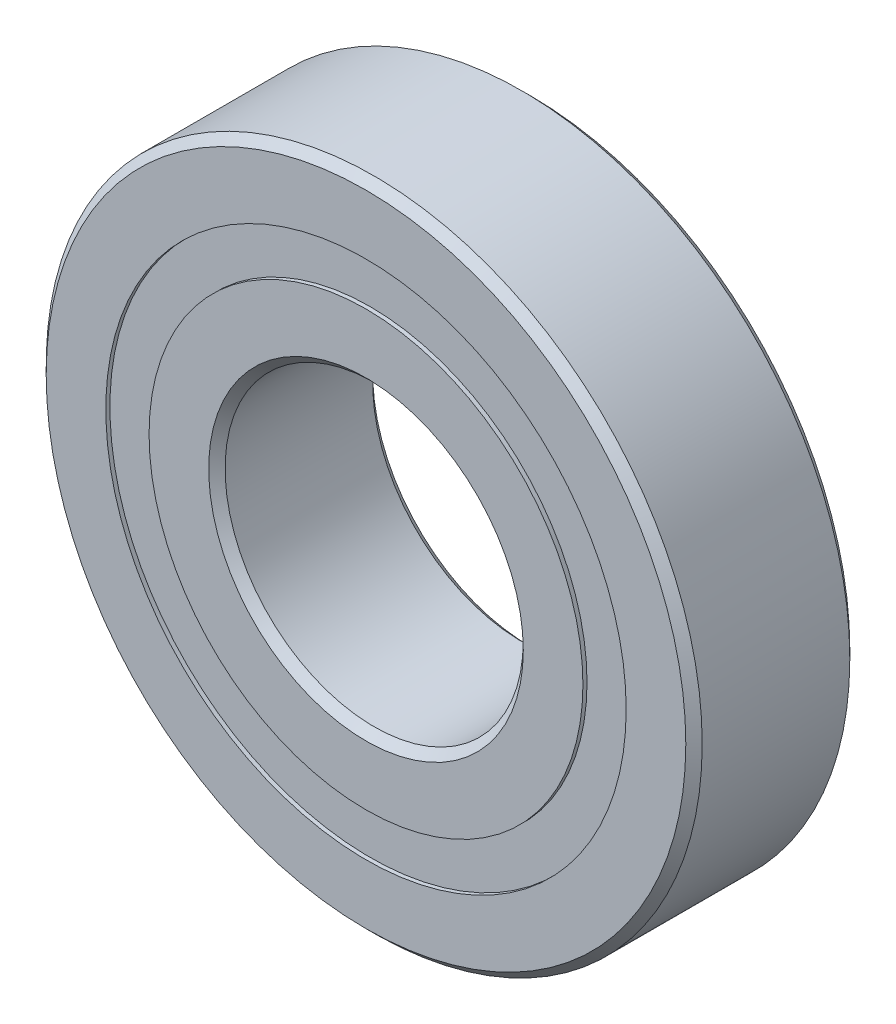
ISO-10303-21;
HEADER;
FILE_DESCRIPTION(('STEP AP214'),'2;1');
FILE_NAME('part.step','',(''),(''),'','','');
FILE_SCHEMA(('AUTOMOTIVE_DESIGN { 1 0 10303 214 1 1 1 1 }'));
ENDSEC;
DATA;
#1=APPLICATION_CONTEXT('core data for automotive mechanical design processes');
#2=APPLICATION_PROTOCOL_DEFINITION('international standard','automotive_design',2000,#1);
#3=PRODUCT_CONTEXT('',#1,'mechanical');
#4=PRODUCT('Part','Part','',(#3));
#5=PRODUCT_RELATED_PRODUCT_CATEGORY('part','',(#4));
#6=PRODUCT_DEFINITION_FORMATION('','',#4);
#7=PRODUCT_DEFINITION_CONTEXT('part definition',#1,'design');
#8=PRODUCT_DEFINITION('design','',#6,#7);
#9=PRODUCT_DEFINITION_SHAPE('','',#8);
#10=(LENGTH_UNIT() NAMED_UNIT(*) SI_UNIT(.MILLI.,.METRE.));
#11=(NAMED_UNIT(*) PLANE_ANGLE_UNIT() SI_UNIT($,.RADIAN.));
#12=(NAMED_UNIT(*) SI_UNIT($,.STERADIAN.) SOLID_ANGLE_UNIT());
#13=UNCERTAINTY_MEASURE_WITH_UNIT(LENGTH_MEASURE(1.E-05),#10,'distance_accuracy_value','');
#14=(GEOMETRIC_REPRESENTATION_CONTEXT(3) GLOBAL_UNCERTAINTY_ASSIGNED_CONTEXT((#13)) GLOBAL_UNIT_ASSIGNED_CONTEXT((#10,
#11,#12)) REPRESENTATION_CONTEXT('',''));
#15=CARTESIAN_POINT('',(0.,0.,0.));
#16=DIRECTION('',(0.,0.,1.));
#17=DIRECTION('',(1.,0.,0.));
#18=AXIS2_PLACEMENT_3D('',#15,#16,#17);
#19=CARTESIAN_POINT('',(0.,13.8513736263736,-4.14734375));
#20=DIRECTION('',(0.,0.,1.));
#21=DIRECTION('',(1.,0.,0.));
#22=AXIS2_PLACEMENT_3D('',#19,#20,#21);
#23=PLANE('',#22);
#24=CARTESIAN_POINT('',(0.,0.,-4.14734375));
#25=DIRECTION('',(0.,0.,1.));
#26=DIRECTION('',(1.,0.,0.));
#27=AXIS2_PLACEMENT_3D('',#24,#25,#26);
#28=CIRCLE('',#27,13.8513736263736);
#29=CARTESIAN_POINT('',(13.8513736263736,0.,-4.14734375));
#30=VERTEX_POINT('',#29);
#31=EDGE_CURVE('E57',#30,#30,#28,.T.);
#32=ORIENTED_EDGE('',*,*,#31,.F.);
#33=EDGE_LOOP('',(#32));
#34=FACE_BOUND('',#33,.T.);
#35=CARTESIAN_POINT('',(0.,0.,-4.14734375));
#36=DIRECTION('',(0.,0.,1.));
#37=DIRECTION('',(1.,0.,0.));
#38=AXIS2_PLACEMENT_3D('',#35,#36,#37);
#39=CIRCLE('',#38,11.5486263736264);
#40=CARTESIAN_POINT('',(11.5486263736264,0.,-4.14734375));
#41=VERTEX_POINT('',#40);
#42=EDGE_CURVE('E11',#41,#41,#39,.T.);
#43=ORIENTED_EDGE('',*,*,#42,.T.);
#44=EDGE_LOOP('',(#43));
#45=FACE_BOUND('',#44,.T.);
#46=ADVANCED_FACE('F43',(#34,#45),#23,.F.);
#47=CARTESIAN_POINT('',(0.,0.,4.365625));
#48=DIRECTION('',(0.,0.,1.));
#49=DIRECTION('',(1.,0.,0.));
#50=AXIS2_PLACEMENT_3D('',#47,#48,#49);
#51=CYLINDRICAL_SURFACE('',#50,11.5486263736264);
#52=ORIENTED_EDGE('',*,*,#42,.F.);
#53=EDGE_LOOP('',(#52));
#54=FACE_BOUND('',#53,.T.);
#55=CARTESIAN_POINT('',(0.,0.,-2.25617798111032));
#56=DIRECTION('',(0.,0.,1.));
#57=DIRECTION('',(1.,0.,0.));
#58=AXIS2_PLACEMENT_3D('',#55,#56,#57);
#59=CIRCLE('',#58,11.5486263736264);
#60=CARTESIAN_POINT('',(11.5486263736264,0.,-2.25617798111032));
#61=VERTEX_POINT('',#60);
#62=EDGE_CURVE('E49',#61,#61,#59,.T.);
#63=ORIENTED_EDGE('',*,*,#62,.T.);
#64=EDGE_LOOP('',(#63));
#65=FACE_BOUND('',#64,.T.);
#66=ADVANCED_FACE('F66',(#54,#65),#51,.F.);
#67=CARTESIAN_POINT('',(0.,13.8513736263736,-2.25617798111032));
#68=DIRECTION('',(0.,0.,-1.));
#69=DIRECTION('',(-1.,0.,0.));
#70=AXIS2_PLACEMENT_3D('',#67,#68,#69);
#71=PLANE('',#70);
#72=ORIENTED_EDGE('',*,*,#62,.F.);
#73=EDGE_LOOP('',(#72));
#74=FACE_BOUND('',#73,.T.);
#75=CARTESIAN_POINT('',(0.,0.,-2.25617798111032));
#76=DIRECTION('',(0.,0.,1.));
#77=DIRECTION('',(1.,0.,0.));
#78=AXIS2_PLACEMENT_3D('',#75,#76,#77);
#79=CIRCLE('',#78,13.8513736263736);
#80=CARTESIAN_POINT('',(13.8513736263736,0.,-2.25617798111032));
#81=VERTEX_POINT('',#80);
#82=EDGE_CURVE('E53',#81,#81,#79,.T.);
#83=ORIENTED_EDGE('',*,*,#82,.T.);
#84=EDGE_LOOP('',(#83));
#85=FACE_BOUND('',#84,.T.);
#86=ADVANCED_FACE('F70',(#74,#85),#71,.F.);
#87=CARTESIAN_POINT('',(0.,0.,4.365625));
#88=DIRECTION('',(0.,0.,1.));
#89=DIRECTION('',(1.,0.,0.));
#90=AXIS2_PLACEMENT_3D('',#87,#88,#89);
#91=CYLINDRICAL_SURFACE('',#90,13.8513736263736);
#92=ORIENTED_EDGE('',*,*,#82,.F.);
#93=EDGE_LOOP('',(#92));
#94=FACE_BOUND('',#93,.T.);
#95=ORIENTED_EDGE('',*,*,#31,.T.);
#96=EDGE_LOOP('',(#95));
#97=FACE_BOUND('',#96,.T.);
#98=ADVANCED_FACE('F63',(#94,#97),#91,.T.);
#99=CLOSED_SHELL('',(#46,#66,#86,#98));
#100=MANIFOLD_SOLID_BREP('B2',#99);
#101=CARTESIAN_POINT('',(0.,13.8513736263736,4.14734375));
#102=DIRECTION('',(0.,0.,-1.));
#103=DIRECTION('',(-1.,0.,0.));
#104=AXIS2_PLACEMENT_3D('',#101,#102,#103);
#105=PLANE('',#104);
#106=CARTESIAN_POINT('',(0.,0.,4.14734375));
#107=DIRECTION('',(0.,0.,1.));
#108=DIRECTION('',(1.,0.,0.));
#109=AXIS2_PLACEMENT_3D('',#106,#107,#108);
#110=CIRCLE('',#109,11.5486263736264);
#111=CARTESIAN_POINT('',(11.5486263736264,0.,4.14734375));
#112=VERTEX_POINT('',#111);
#113=EDGE_CURVE('E42',#112,#112,#110,.T.);
#114=ORIENTED_EDGE('',*,*,#113,.F.);
#115=EDGE_LOOP('',(#114));
#116=FACE_BOUND('',#115,.T.);
#117=CARTESIAN_POINT('',(0.,0.,4.14734375));
#118=DIRECTION('',(0.,0.,1.));
#119=DIRECTION('',(1.,0.,0.));
#120=AXIS2_PLACEMENT_3D('',#117,#118,#119);
#121=CIRCLE('',#120,13.8513736263736);
#122=CARTESIAN_POINT('',(13.8513736263736,0.,4.14734375));
#123=VERTEX_POINT('',#122);
#124=EDGE_CURVE('E124',#123,#123,#121,.T.);
#125=ORIENTED_EDGE('',*,*,#124,.T.);
#126=EDGE_LOOP('',(#125));
#127=FACE_BOUND('',#126,.T.);
#128=ADVANCED_FACE('F110',(#116,#127),#105,.F.);
#129=CARTESIAN_POINT('',(0.,0.,4.365625));
#130=DIRECTION('',(0.,0.,1.));
#131=DIRECTION('',(1.,0.,0.));
#132=AXIS2_PLACEMENT_3D('',#129,#130,#131);
#133=CYLINDRICAL_SURFACE('',#132,11.5486263736264);
#134=CARTESIAN_POINT('',(0.,0.,2.25617798111032));
#135=DIRECTION('',(0.,0.,1.));
#136=DIRECTION('',(1.,0.,0.));
#137=AXIS2_PLACEMENT_3D('',#134,#135,#136);
#138=CIRCLE('',#137,11.5486263736264);
#139=CARTESIAN_POINT('',(11.5486263736264,0.,2.25617798111032));
#140=VERTEX_POINT('',#139);
#141=EDGE_CURVE('E116',#140,#140,#138,.T.);
#142=ORIENTED_EDGE('',*,*,#141,.F.);
#143=EDGE_LOOP('',(#142));
#144=FACE_BOUND('',#143,.T.);
#145=ORIENTED_EDGE('',*,*,#113,.T.);
#146=EDGE_LOOP('',(#145));
#147=FACE_BOUND('',#146,.T.);
#148=ADVANCED_FACE('F139',(#144,#147),#133,.F.);
#149=CARTESIAN_POINT('',(0.,13.8513736263736,2.25617798111032));
#150=DIRECTION('',(0.,0.,1.));
#151=DIRECTION('',(1.,0.,0.));
#152=AXIS2_PLACEMENT_3D('',#149,#150,#151);
#153=PLANE('',#152);
#154=CARTESIAN_POINT('',(0.,0.,2.25617798111032));
#155=DIRECTION('',(0.,0.,1.));
#156=DIRECTION('',(1.,0.,0.));
#157=AXIS2_PLACEMENT_3D('',#154,#155,#156);
#158=CIRCLE('',#157,13.8513736263736);
#159=CARTESIAN_POINT('',(13.8513736263736,0.,2.25617798111032));
#160=VERTEX_POINT('',#159);
#161=EDGE_CURVE('E120',#160,#160,#158,.T.);
#162=ORIENTED_EDGE('',*,*,#161,.F.);
#163=EDGE_LOOP('',(#162));
#164=FACE_BOUND('',#163,.T.);
#165=ORIENTED_EDGE('',*,*,#141,.T.);
#166=EDGE_LOOP('',(#165));
#167=FACE_BOUND('',#166,.T.);
#168=ADVANCED_FACE('F134',(#164,#167),#153,.F.);
#169=CARTESIAN_POINT('',(0.,0.,4.365625));
#170=DIRECTION('',(0.,0.,1.));
#171=DIRECTION('',(1.,0.,0.));
#172=AXIS2_PLACEMENT_3D('',#169,#170,#171);
#173=CYLINDRICAL_SURFACE('',#172,13.8513736263736);
#174=ORIENTED_EDGE('',*,*,#124,.F.);
#175=EDGE_LOOP('',(#174));
#176=FACE_BOUND('',#175,.T.);
#177=ORIENTED_EDGE('',*,*,#161,.T.);
#178=EDGE_LOOP('',(#177));
#179=FACE_BOUND('',#178,.T.);
#180=ADVANCED_FACE('F131',(#176,#179),#173,.T.);
#181=CLOSED_SHELL('',(#128,#148,#168,#180));
#182=MANIFOLD_SOLID_BREP('B6',#181);
#183=CARTESIAN_POINT('',(-7.46487270411427,10.2745158285619,0.));
#184=DIRECTION('',(0.,0.,1.));
#185=DIRECTION('',(-0.587785252292462,0.809016994374955,0.));
#186=AXIS2_PLACEMENT_3D('',#183,#184,#185);
#187=SPHERICAL_SURFACE('',#186,2.25617798111032);
#188=CARTESIAN_POINT('',(-7.46487270411427,10.2745158285619,2.25617798111032));
#189=VERTEX_POINT('',#188);
#190=VERTEX_LOOP('',#189);
#191=FACE_BOUND('',#190,.T.);
#192=ADVANCED_FACE('F177',(#191),#187,.T.);
#193=CLOSED_SHELL('',(#192));
#194=MANIFOLD_SOLID_BREP('B37',#193);
#195=CARTESIAN_POINT('',(-12.0784177569484,3.92451582856197,0.));
#196=DIRECTION('',(0.,0.,1.));
#197=DIRECTION('',(-0.95105651629515,0.309016994374958,0.));
#198=AXIS2_PLACEMENT_3D('',#195,#196,#197);
#199=SPHERICAL_SURFACE('',#198,2.25617798111032);
#200=CARTESIAN_POINT('',(-12.0784177569484,3.92451582856197,2.25617798111032));
#201=VERTEX_POINT('',#200);
#202=VERTEX_LOOP('',#201);
#203=FACE_BOUND('',#202,.T.);
#204=ADVANCED_FACE('F197',(#203),#199,.T.);
#205=CLOSED_SHELL('',(#204));
#206=MANIFOLD_SOLID_BREP('B106',#205);
#207=CARTESIAN_POINT('',(-12.0784177569485,-3.92451582856172,0.));
#208=DIRECTION('',(0.,0.,1.));
#209=DIRECTION('',(-0.951056516295157,-0.309016994374938,0.));
#210=AXIS2_PLACEMENT_3D('',#207,#208,#209);
#211=SPHERICAL_SURFACE('',#210,2.25617798111032);
#212=CARTESIAN_POINT('',(-12.0784177569485,-3.92451582856172,2.25617798111032));
#213=VERTEX_POINT('',#212);
#214=VERTEX_LOOP('',#213);
#215=FACE_BOUND('',#214,.T.);
#216=ADVANCED_FACE('F217',(#215),#211,.T.);
#217=CLOSED_SHELL('',(#216));
#218=MANIFOLD_SOLID_BREP('B173',#217);
#219=CARTESIAN_POINT('',(-7.4648727041145,-10.2745158285618,0.));
#220=DIRECTION('',(0.,0.,1.));
#221=DIRECTION('',(-0.58778525229248,-0.809016994374942,0.));
#222=AXIS2_PLACEMENT_3D('',#219,#220,#221);
#223=SPHERICAL_SURFACE('',#222,2.25617798111032);
#224=CARTESIAN_POINT('',(-7.4648727041145,-10.2745158285618,2.25617798111032));
#225=VERTEX_POINT('',#224);
#226=VERTEX_LOOP('',#225);
#227=FACE_BOUND('',#226,.T.);
#228=ADVANCED_FACE('F237',(#227),#223,.T.);
#229=CLOSED_SHELL('',(#228));
#230=MANIFOLD_SOLID_BREP('B193',#229);
#231=CARTESIAN_POINT('',(0.,-12.7,0.));
#232=DIRECTION('',(0.,0.,1.));
#233=DIRECTION('',(0.,-1.,0.));
#234=AXIS2_PLACEMENT_3D('',#231,#232,#233);
#235=SPHERICAL_SURFACE('',#234,2.25617798111032);
#236=CARTESIAN_POINT('',(0.,-12.7,2.25617798111032));
#237=VERTEX_POINT('',#236);
#238=VERTEX_LOOP('',#237);
#239=FACE_BOUND('',#238,.T.);
#240=ADVANCED_FACE('F257',(#239),#235,.T.);
#241=CLOSED_SHELL('',(#240));
#242=MANIFOLD_SOLID_BREP('B213',#241);
#243=CARTESIAN_POINT('',(7.46487270411435,-10.2745158285619,0.));
#244=DIRECTION('',(0.,0.,1.));
#245=DIRECTION('',(0.587785252292469,-0.809016994374951,0.));
#246=AXIS2_PLACEMENT_3D('',#243,#244,#245);
#247=SPHERICAL_SURFACE('',#246,2.25617798111032);
#248=CARTESIAN_POINT('',(7.46487270411435,-10.2745158285619,2.25617798111032));
#249=VERTEX_POINT('',#248);
#250=VERTEX_LOOP('',#249);
#251=FACE_BOUND('',#250,.T.);
#252=ADVANCED_FACE('F277',(#251),#247,.T.);
#253=CLOSED_SHELL('',(#252));
#254=MANIFOLD_SOLID_BREP('B233',#253);
#255=CARTESIAN_POINT('',(12.0784177569484,-3.92451582856189,0.));
#256=DIRECTION('',(0.,0.,1.));
#257=DIRECTION('',(0.951056516295152,-0.309016994374952,0.));
#258=AXIS2_PLACEMENT_3D('',#255,#256,#257);
#259=SPHERICAL_SURFACE('',#258,2.25617798111032);
#260=CARTESIAN_POINT('',(12.0784177569484,-3.92451582856189,2.25617798111032));
#261=VERTEX_POINT('',#260);
#262=VERTEX_LOOP('',#261);
#263=FACE_BOUND('',#262,.T.);
#264=ADVANCED_FACE('F297',(#263),#259,.T.);
#265=CLOSED_SHELL('',(#264));
#266=MANIFOLD_SOLID_BREP('B253',#265);
#267=CARTESIAN_POINT('',(12.0784177569485,3.9245158285618,0.));
#268=DIRECTION('',(0.,0.,1.));
#269=DIRECTION('',(0.951056516295155,0.309016994374945,0.));
#270=AXIS2_PLACEMENT_3D('',#267,#268,#269);
#271=SPHERICAL_SURFACE('',#270,2.25617798111032);
#272=CARTESIAN_POINT('',(12.0784177569485,3.9245158285618,2.25617798111032));
#273=VERTEX_POINT('',#272);
#274=VERTEX_LOOP('',#273);
#275=FACE_BOUND('',#274,.T.);
#276=ADVANCED_FACE('F317',(#275),#271,.T.);
#277=CLOSED_SHELL('',(#276));
#278=MANIFOLD_SOLID_BREP('B273',#277);
#279=CARTESIAN_POINT('',(7.46487270411442,10.2745158285618,0.));
#280=DIRECTION('',(0.,0.,1.));
#281=DIRECTION('',(0.587785252292474,0.809016994374947,0.));
#282=AXIS2_PLACEMENT_3D('',#279,#280,#281);
#283=SPHERICAL_SURFACE('',#282,2.25617798111032);
#284=CARTESIAN_POINT('',(7.46487270411442,10.2745158285618,2.25617798111032));
#285=VERTEX_POINT('',#284);
#286=VERTEX_LOOP('',#285);
#287=FACE_BOUND('',#286,.T.);
#288=ADVANCED_FACE('F337',(#287),#283,.T.);
#289=CLOSED_SHELL('',(#288));
#290=MANIFOLD_SOLID_BREP('B293',#289);
#291=CARTESIAN_POINT('',(0.,12.7,0.));
#292=DIRECTION('',(0.,0.,1.));
#293=DIRECTION('',(0.,1.,0.));
#294=AXIS2_PLACEMENT_3D('',#291,#292,#293);
#295=SPHERICAL_SURFACE('',#294,2.25617798111032);
#296=CARTESIAN_POINT('',(0.,12.7,2.25617798111032));
#297=VERTEX_POINT('',#296);
#298=VERTEX_LOOP('',#297);
#299=FACE_BOUND('',#298,.T.);
#300=ADVANCED_FACE('F359',(#299),#295,.T.);
#301=CLOSED_SHELL('',(#300));
#302=MANIFOLD_SOLID_BREP('B313',#301);
#303=CARTESIAN_POINT('',(0.,11.5486263736264,4.365625));
#304=DIRECTION('',(0.,0.,-1.));
#305=DIRECTION('',(-1.,0.,0.));
#306=AXIS2_PLACEMENT_3D('',#303,#304,#305);
#307=PLANE('',#306);
#308=CARTESIAN_POINT('',(0.,0.,4.365625));
#309=DIRECTION('',(0.,0.,1.));
#310=DIRECTION('',(1.,0.,0.));
#311=AXIS2_PLACEMENT_3D('',#308,#309,#310);
#312=CIRCLE('',#311,8.3740625);
#313=CARTESIAN_POINT('',(8.3740625,0.,4.365625));
#314=VERTEX_POINT('',#313);
#315=EDGE_CURVE('E406',#314,#314,#312,.T.);
#316=ORIENTED_EDGE('',*,*,#315,.F.);
#317=EDGE_LOOP('',(#316));
#318=FACE_BOUND('',#317,.T.);
#319=CARTESIAN_POINT('',(0.,0.,4.365625));
#320=DIRECTION('',(0.,0.,1.));
#321=DIRECTION('',(1.,0.,0.));
#322=AXIS2_PLACEMENT_3D('',#319,#320,#321);
#323=CIRCLE('',#322,11.5486263736264);
#324=CARTESIAN_POINT('',(11.5486263736264,0.,4.365625));
#325=VERTEX_POINT('',#324);
#326=EDGE_CURVE('E358',#325,#325,#323,.T.);
#327=ORIENTED_EDGE('',*,*,#326,.T.);
#328=EDGE_LOOP('',(#327));
#329=FACE_BOUND('',#328,.T.);
#330=ADVANCED_FACE('F378',(#318,#329),#307,.F.);
#331=CARTESIAN_POINT('',(0.,0.,4.365625));
#332=DIRECTION('',(0.,0.,1.));
#333=DIRECTION('',(1.,0.,0.));
#334=AXIS2_PLACEMENT_3D('',#331,#332,#333);
#335=CYLINDRICAL_SURFACE('',#334,11.5486263736264);
#336=ORIENTED_EDGE('',*,*,#326,.F.);
#337=EDGE_LOOP('',(#336));
#338=FACE_BOUND('',#337,.T.);
#339=CARTESIAN_POINT('',(0.,0.,1.94027777777778));
#340=DIRECTION('',(0.,0.,1.));
#341=DIRECTION('',(1.,0.,0.));
#342=AXIS2_PLACEMENT_3D('',#339,#340,#341);
#343=CIRCLE('',#342,11.5486263736264);
#344=CARTESIAN_POINT('',(11.5486263736264,0.,1.94027777777778));
#345=VERTEX_POINT('',#344);
#346=EDGE_CURVE('E384',#345,#345,#343,.T.);
#347=ORIENTED_EDGE('',*,*,#346,.T.);
#348=EDGE_LOOP('',(#347));
#349=FACE_BOUND('',#348,.T.);
#350=ADVANCED_FACE('F413',(#338,#349),#335,.T.);
#351=CARTESIAN_POINT('',(0.,0.,0.));
#352=DIRECTION('',(0.,0.,1.));
#353=DIRECTION('',(1.,0.,0.));
#354=AXIS2_PLACEMENT_3D('',#351,#352,#353);
#355=TOROIDAL_SURFACE('',#354,12.7,2.25617798111032);
#356=ORIENTED_EDGE('',*,*,#346,.F.);
#357=EDGE_LOOP('',(#356));
#358=FACE_BOUND('',#357,.T.);
#359=CARTESIAN_POINT('',(0.,0.,-1.94027777777778));
#360=DIRECTION('',(0.,0.,1.));
#361=DIRECTION('',(1.,0.,0.));
#362=AXIS2_PLACEMENT_3D('',#359,#360,#361);
#363=CIRCLE('',#362,11.5486263736264);
#364=CARTESIAN_POINT('',(11.5486263736264,0.,-1.94027777777778));
#365=VERTEX_POINT('',#364);
#366=EDGE_CURVE('E388',#365,#365,#363,.T.);
#367=ORIENTED_EDGE('',*,*,#366,.T.);
#368=EDGE_LOOP('',(#367));
#369=FACE_BOUND('',#368,.T.);
#370=ADVANCED_FACE('F417',(#358,#369),#355,.F.);
#371=CARTESIAN_POINT('',(0.,0.,4.365625));
#372=DIRECTION('',(0.,0.,1.));
#373=DIRECTION('',(1.,0.,0.));
#374=AXIS2_PLACEMENT_3D('',#371,#372,#373);
#375=CYLINDRICAL_SURFACE('',#374,11.5486263736264);
#376=ORIENTED_EDGE('',*,*,#366,.F.);
#377=EDGE_LOOP('',(#376));
#378=FACE_BOUND('',#377,.T.);
#379=CARTESIAN_POINT('',(0.,0.,-4.365625));
#380=DIRECTION('',(0.,0.,1.));
#381=DIRECTION('',(1.,0.,0.));
#382=AXIS2_PLACEMENT_3D('',#379,#380,#381);
#383=CIRCLE('',#382,11.5486263736264);
#384=CARTESIAN_POINT('',(11.5486263736264,0.,-4.365625));
#385=VERTEX_POINT('',#384);
#386=EDGE_CURVE('E392',#385,#385,#383,.T.);
#387=ORIENTED_EDGE('',*,*,#386,.T.);
#388=EDGE_LOOP('',(#387));
#389=FACE_BOUND('',#388,.T.);
#390=ADVANCED_FACE('F422',(#378,#389),#375,.T.);
#391=CARTESIAN_POINT('',(0.,8.3740625,-4.365625));
#392=DIRECTION('',(0.,0.,1.));
#393=DIRECTION('',(1.,0.,0.));
#394=AXIS2_PLACEMENT_3D('',#391,#392,#393);
#395=PLANE('',#394);
#396=ORIENTED_EDGE('',*,*,#386,.F.);
#397=EDGE_LOOP('',(#396));
#398=FACE_BOUND('',#397,.T.);
#399=CARTESIAN_POINT('',(0.,0.,-4.365625));
#400=DIRECTION('',(0.,0.,1.));
#401=DIRECTION('',(1.,0.,0.));
#402=AXIS2_PLACEMENT_3D('',#399,#400,#401);
#403=CIRCLE('',#402,8.3740625);
#404=CARTESIAN_POINT('',(8.3740625,0.,-4.365625));
#405=VERTEX_POINT('',#404);
#406=EDGE_CURVE('E397',#405,#405,#403,.T.);
#407=ORIENTED_EDGE('',*,*,#406,.T.);
#408=EDGE_LOOP('',(#407));
#409=FACE_BOUND('',#408,.T.);
#410=ADVANCED_FACE('F428',(#398,#409),#395,.F.);
#411=CARTESIAN_POINT('',(0.,0.,-3.9290625));
#412=DIRECTION('',(0.,0.,-1.));
#413=DIRECTION('',(-1.,0.,0.));
#414=AXIS2_PLACEMENT_3D('',#411,#412,#413);
#415=CONICAL_SURFACE('',#414,7.9375,0.78539816339745);
#416=ORIENTED_EDGE('',*,*,#406,.F.);
#417=EDGE_LOOP('',(#416));
#418=FACE_BOUND('',#417,.T.);
#419=CARTESIAN_POINT('',(0.,0.,-3.9290625));
#420=DIRECTION('',(0.,0.,1.));
#421=DIRECTION('',(1.,0.,0.));
#422=AXIS2_PLACEMENT_3D('',#419,#420,#421);
#423=CIRCLE('',#422,7.9375);
#424=CARTESIAN_POINT('',(7.9375,0.,-3.9290625));
#425=VERTEX_POINT('',#424);
#426=EDGE_CURVE('E400',#425,#425,#423,.T.);
#427=ORIENTED_EDGE('',*,*,#426,.T.);
#428=EDGE_LOOP('',(#427));
#429=FACE_BOUND('',#428,.T.);
#430=ADVANCED_FACE('F432',(#418,#429),#415,.F.);
#431=CARTESIAN_POINT('',(0.,0.,4.365625));
#432=DIRECTION('',(0.,0.,1.));
#433=DIRECTION('',(1.,0.,0.));
#434=AXIS2_PLACEMENT_3D('',#431,#432,#433);
#435=CYLINDRICAL_SURFACE('',#434,7.9375);
#436=ORIENTED_EDGE('',*,*,#426,.F.);
#437=EDGE_LOOP('',(#436));
#438=FACE_BOUND('',#437,.T.);
#439=CARTESIAN_POINT('',(0.,0.,3.9290625));
#440=DIRECTION('',(0.,0.,1.));
#441=DIRECTION('',(1.,0.,0.));
#442=AXIS2_PLACEMENT_3D('',#439,#440,#441);
#443=CIRCLE('',#442,7.9375);
#444=CARTESIAN_POINT('',(7.9375,0.,3.9290625));
#445=VERTEX_POINT('',#444);
#446=EDGE_CURVE('E403',#445,#445,#443,.T.);
#447=ORIENTED_EDGE('',*,*,#446,.T.);
#448=EDGE_LOOP('',(#447));
#449=FACE_BOUND('',#448,.T.);
#450=ADVANCED_FACE('F436',(#438,#449),#435,.F.);
#451=CARTESIAN_POINT('',(0.,0.,4.365625));
#452=DIRECTION('',(0.,0.,1.));
#453=DIRECTION('',(1.,0.,0.));
#454=AXIS2_PLACEMENT_3D('',#451,#452,#453);
#455=CONICAL_SURFACE('',#454,8.3740625,0.785398163397445);
#456=ORIENTED_EDGE('',*,*,#446,.F.);
#457=EDGE_LOOP('',(#456));
#458=FACE_BOUND('',#457,.T.);
#459=ORIENTED_EDGE('',*,*,#315,.T.);
#460=EDGE_LOOP('',(#459));
#461=FACE_BOUND('',#460,.T.);
#462=ADVANCED_FACE('F410',(#458,#461),#455,.F.);
#463=CLOSED_SHELL('',(#330,#350,#370,#390,#410,#430,#450,#462));
#464=MANIFOLD_SOLID_BREP('B333',#463);
#465=CARTESIAN_POINT('',(0.,0.,3.9290625));
#466=DIRECTION('',(0.,0.,-1.));
#467=DIRECTION('',(-1.,0.,0.));
#468=AXIS2_PLACEMENT_3D('',#465,#466,#467);
#469=CONICAL_SURFACE('',#468,17.4625,0.785398163397449);
#470=CARTESIAN_POINT('',(0.,0.,4.365625));
#471=DIRECTION('',(0.,0.,1.));
#472=DIRECTION('',(1.,0.,0.));
#473=AXIS2_PLACEMENT_3D('',#470,#471,#472);
#474=CIRCLE('',#473,17.0259375);
#475=CARTESIAN_POINT('',(17.0259375,0.,4.365625));
#476=VERTEX_POINT('',#475);
#477=EDGE_CURVE('E527',#476,#476,#474,.T.);
#478=ORIENTED_EDGE('',*,*,#477,.F.);
#479=EDGE_LOOP('',(#478));
#480=FACE_BOUND('',#479,.T.);
#481=CARTESIAN_POINT('',(0.,0.,3.9290625));
#482=DIRECTION('',(0.,0.,1.));
#483=DIRECTION('',(1.,0.,0.));
#484=AXIS2_PLACEMENT_3D('',#481,#482,#483);
#485=CIRCLE('',#484,17.4625);
#486=CARTESIAN_POINT('',(17.4625,0.,3.9290625));
#487=VERTEX_POINT('',#486);
#488=EDGE_CURVE('E377',#487,#487,#485,.T.);
#489=ORIENTED_EDGE('',*,*,#488,.T.);
#490=EDGE_LOOP('',(#489));
#491=FACE_BOUND('',#490,.T.);
#492=ADVANCED_FACE('F499',(#480,#491),#469,.T.);
#493=CARTESIAN_POINT('',(0.,0.,4.365625));
#494=DIRECTION('',(0.,0.,1.));
#495=DIRECTION('',(1.,0.,0.));
#496=AXIS2_PLACEMENT_3D('',#493,#494,#495);
#497=CYLINDRICAL_SURFACE('',#496,17.4625);
#498=ORIENTED_EDGE('',*,*,#488,.F.);
#499=EDGE_LOOP('',(#498));
#500=FACE_BOUND('',#499,.T.);
#501=CARTESIAN_POINT('',(0.,0.,-3.9290625));
#502=DIRECTION('',(0.,0.,1.));
#503=DIRECTION('',(1.,0.,0.));
#504=AXIS2_PLACEMENT_3D('',#501,#502,#503);
#505=CIRCLE('',#504,17.4625);
#506=CARTESIAN_POINT('',(17.4625,0.,-3.9290625));
#507=VERTEX_POINT('',#506);
#508=EDGE_CURVE('E505',#507,#507,#505,.T.);
#509=ORIENTED_EDGE('',*,*,#508,.T.);
#510=EDGE_LOOP('',(#509));
#511=FACE_BOUND('',#510,.T.);
#512=ADVANCED_FACE('F534',(#500,#511),#497,.T.);
#513=CARTESIAN_POINT('',(0.,0.,-4.365625));
#514=DIRECTION('',(0.,0.,1.));
#515=DIRECTION('',(1.,0.,0.));
#516=AXIS2_PLACEMENT_3D('',#513,#514,#515);
#517=CONICAL_SURFACE('',#516,17.0259375,0.78539816339745);
#518=ORIENTED_EDGE('',*,*,#508,.F.);
#519=EDGE_LOOP('',(#518));
#520=FACE_BOUND('',#519,.T.);
#521=CARTESIAN_POINT('',(0.,0.,-4.365625));
#522=DIRECTION('',(0.,0.,1.));
#523=DIRECTION('',(1.,0.,0.));
#524=AXIS2_PLACEMENT_3D('',#521,#522,#523);
#525=CIRCLE('',#524,17.0259375);
#526=CARTESIAN_POINT('',(17.0259375,0.,-4.365625));
#527=VERTEX_POINT('',#526);
#528=EDGE_CURVE('E509',#527,#527,#525,.T.);
#529=ORIENTED_EDGE('',*,*,#528,.T.);
#530=EDGE_LOOP('',(#529));
#531=FACE_BOUND('',#530,.T.);
#532=ADVANCED_FACE('F538',(#520,#531),#517,.T.);
#533=CARTESIAN_POINT('',(0.,17.0259375,-4.365625));
#534=DIRECTION('',(0.,0.,1.));
#535=DIRECTION('',(1.,0.,0.));
#536=AXIS2_PLACEMENT_3D('',#533,#534,#535);
#537=PLANE('',#536);
#538=ORIENTED_EDGE('',*,*,#528,.F.);
#539=EDGE_LOOP('',(#538));
#540=FACE_BOUND('',#539,.T.);
#541=CARTESIAN_POINT('',(0.,0.,-4.365625));
#542=DIRECTION('',(0.,0.,1.));
#543=DIRECTION('',(1.,0.,0.));
#544=AXIS2_PLACEMENT_3D('',#541,#542,#543);
#545=CIRCLE('',#544,13.8513736263736);
#546=CARTESIAN_POINT('',(13.8513736263736,0.,-4.365625));
#547=VERTEX_POINT('',#546);
#548=EDGE_CURVE('E513',#547,#547,#545,.T.);
#549=ORIENTED_EDGE('',*,*,#548,.T.);
#550=EDGE_LOOP('',(#549));
#551=FACE_BOUND('',#550,.T.);
#552=ADVANCED_FACE('F543',(#540,#551),#537,.F.);
#553=CARTESIAN_POINT('',(0.,0.,4.365625));
#554=DIRECTION('',(0.,0.,1.));
#555=DIRECTION('',(1.,0.,0.));
#556=AXIS2_PLACEMENT_3D('',#553,#554,#555);
#557=CYLINDRICAL_SURFACE('',#556,13.8513736263736);
#558=ORIENTED_EDGE('',*,*,#548,.F.);
#559=EDGE_LOOP('',(#558));
#560=FACE_BOUND('',#559,.T.);
#561=CARTESIAN_POINT('',(0.,0.,-1.94027777777778));
#562=DIRECTION('',(0.,0.,1.));
#563=DIRECTION('',(1.,0.,0.));
#564=AXIS2_PLACEMENT_3D('',#561,#562,#563);
#565=CIRCLE('',#564,13.8513736263736);
#566=CARTESIAN_POINT('',(13.8513736263736,0.,-1.94027777777778));
#567=VERTEX_POINT('',#566);
#568=EDGE_CURVE('E518',#567,#567,#565,.T.);
#569=ORIENTED_EDGE('',*,*,#568,.T.);
#570=EDGE_LOOP('',(#569));
#571=FACE_BOUND('',#570,.T.);
#572=ADVANCED_FACE('F549',(#560,#571),#557,.F.);
#573=CARTESIAN_POINT('',(0.,0.,0.));
#574=DIRECTION('',(0.,0.,1.));
#575=DIRECTION('',(1.,0.,0.));
#576=AXIS2_PLACEMENT_3D('',#573,#574,#575);
#577=TOROIDAL_SURFACE('',#576,12.7,2.25617798111032);
#578=ORIENTED_EDGE('',*,*,#568,.F.);
#579=EDGE_LOOP('',(#578));
#580=FACE_BOUND('',#579,.T.);
#581=CARTESIAN_POINT('',(0.,0.,1.94027777777778));
#582=DIRECTION('',(0.,0.,1.));
#583=DIRECTION('',(1.,0.,0.));
#584=AXIS2_PLACEMENT_3D('',#581,#582,#583);
#585=CIRCLE('',#584,13.8513736263736);
#586=CARTESIAN_POINT('',(13.8513736263736,0.,1.94027777777778));
#587=VERTEX_POINT('',#586);
#588=EDGE_CURVE('E521',#587,#587,#585,.T.);
#589=ORIENTED_EDGE('',*,*,#588,.T.);
#590=EDGE_LOOP('',(#589));
#591=FACE_BOUND('',#590,.T.);
#592=ADVANCED_FACE('F553',(#580,#591),#577,.F.);
#593=CARTESIAN_POINT('',(0.,0.,4.365625));
#594=DIRECTION('',(0.,0.,1.));
#595=DIRECTION('',(1.,0.,0.));
#596=AXIS2_PLACEMENT_3D('',#593,#594,#595);
#597=CYLINDRICAL_SURFACE('',#596,13.8513736263736);
#598=ORIENTED_EDGE('',*,*,#588,.F.);
#599=EDGE_LOOP('',(#598));
#600=FACE_BOUND('',#599,.T.);
#601=CARTESIAN_POINT('',(0.,0.,4.365625));
#602=DIRECTION('',(0.,0.,1.));
#603=DIRECTION('',(1.,0.,0.));
#604=AXIS2_PLACEMENT_3D('',#601,#602,#603);
#605=CIRCLE('',#604,13.8513736263736);
#606=CARTESIAN_POINT('',(13.8513736263736,0.,4.365625));
#607=VERTEX_POINT('',#606);
#608=EDGE_CURVE('E524',#607,#607,#605,.T.);
#609=ORIENTED_EDGE('',*,*,#608,.T.);
#610=EDGE_LOOP('',(#609));
#611=FACE_BOUND('',#610,.T.);
#612=ADVANCED_FACE('F557',(#600,#611),#597,.F.);
#613=CARTESIAN_POINT('',(0.,17.0259375,4.365625));
#614=DIRECTION('',(0.,0.,-1.));
#615=DIRECTION('',(-1.,0.,0.));
#616=AXIS2_PLACEMENT_3D('',#613,#614,#615);
#617=PLANE('',#616);
#618=ORIENTED_EDGE('',*,*,#608,.F.);
#619=EDGE_LOOP('',(#618));
#620=FACE_BOUND('',#619,.T.);
#621=ORIENTED_EDGE('',*,*,#477,.T.);
#622=EDGE_LOOP('',(#621));
#623=FACE_BOUND('',#622,.T.);
#624=ADVANCED_FACE('F531',(#620,#623),#617,.F.);
#625=CLOSED_SHELL('',(#492,#512,#532,#552,#572,#592,#612,#624));
#626=MANIFOLD_SOLID_BREP('B353',#625);
#627=ADVANCED_BREP_SHAPE_REPRESENTATION('',(#18,#100,#182,#194,#206,#218,#230,#242,#254,#266,
#278,#290,#302,#464,#626),#14);
#628=SHAPE_DEFINITION_REPRESENTATION(#9,#627);
ENDSEC;
END-ISO-10303-21;
